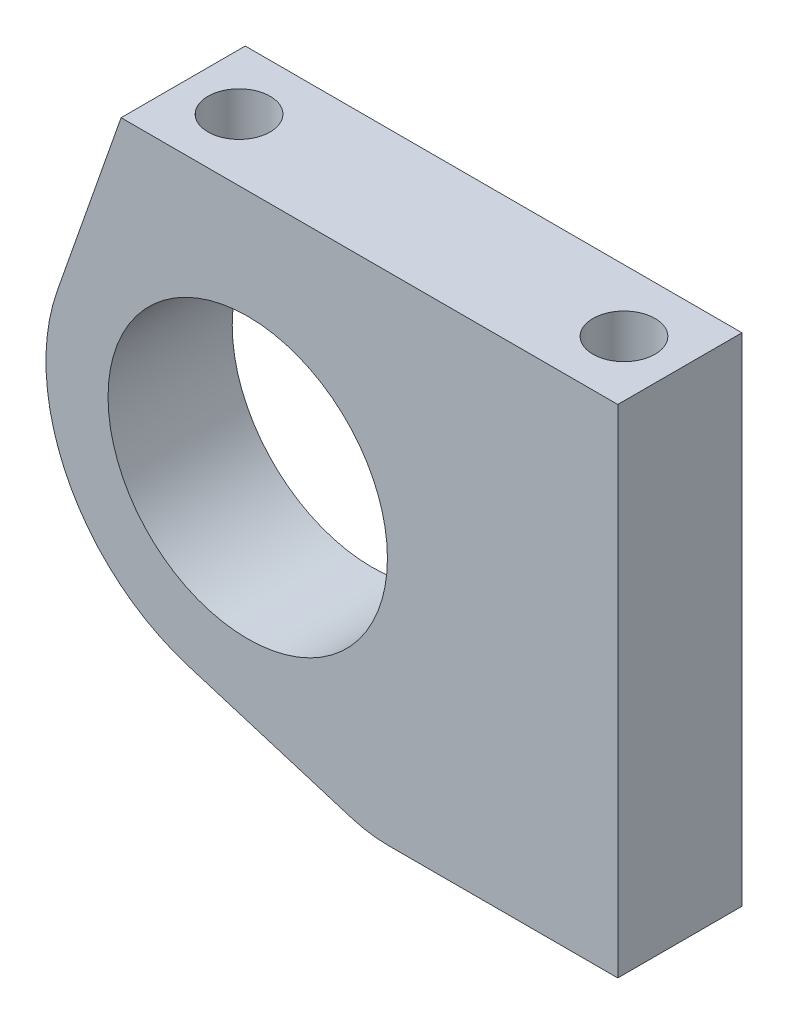
ISO-10303-21;
HEADER;
FILE_DESCRIPTION(('STEP AP214'),'2;1');
FILE_NAME('part.step','',(''),(''),'','','');
FILE_SCHEMA(('AUTOMOTIVE_DESIGN { 1 0 10303 214 1 1 1 1 }'));
ENDSEC;
DATA;
#1=APPLICATION_CONTEXT('core data for automotive mechanical design processes');
#2=APPLICATION_PROTOCOL_DEFINITION('international standard','automotive_design',2000,#1);
#3=PRODUCT_CONTEXT('',#1,'mechanical');
#4=PRODUCT('Part','Part','',(#3));
#5=PRODUCT_RELATED_PRODUCT_CATEGORY('part','',(#4));
#6=PRODUCT_DEFINITION_FORMATION('','',#4);
#7=PRODUCT_DEFINITION_CONTEXT('part definition',#1,'design');
#8=PRODUCT_DEFINITION('design','',#6,#7);
#9=PRODUCT_DEFINITION_SHAPE('','',#8);
#10=(LENGTH_UNIT() NAMED_UNIT(*) SI_UNIT(.MILLI.,.METRE.));
#11=(NAMED_UNIT(*) PLANE_ANGLE_UNIT() SI_UNIT($,.RADIAN.));
#12=(NAMED_UNIT(*) SI_UNIT($,.STERADIAN.) SOLID_ANGLE_UNIT());
#13=UNCERTAINTY_MEASURE_WITH_UNIT(LENGTH_MEASURE(1.E-05),#10,'distance_accuracy_value','');
#14=(GEOMETRIC_REPRESENTATION_CONTEXT(3) GLOBAL_UNCERTAINTY_ASSIGNED_CONTEXT((#13)) GLOBAL_UNIT_ASSIGNED_CONTEXT((#10,
#11,#12)) REPRESENTATION_CONTEXT('',''));
#15=CARTESIAN_POINT('',(0.,0.,0.));
#16=DIRECTION('',(0.,0.,1.));
#17=DIRECTION('',(1.,0.,0.));
#18=AXIS2_PLACEMENT_3D('',#15,#16,#17);
#19=CARTESIAN_POINT('',(2.18135779971547,7.11675250815941,12.7));
#20=DIRECTION('',(-0.293053285829138,-0.956096110056277,0.));
#21=DIRECTION('',(0.956096110056278,-0.293053285829138,0.));
#22=AXIS2_PLACEMENT_3D('',#19,#20,#21);
#23=PLANE('',#22);
#24=DIRECTION('',(-0.956096110056277,0.293053285829138,0.));
#25=VECTOR('',#24,1.);
#26=CARTESIAN_POINT('',(2.18135779971547,7.11675250815941,0.));
#27=LINE('',#26,#25);
#28=CARTESIAN_POINT('',(23.5808786205411,0.557579402285274,0.));
#29=VERTEX_POINT('',#28);
#30=CARTESIAN_POINT('',(6.90611281370116,5.66856652871357,0.));
#31=VERTEX_POINT('',#30);
#32=EDGE_CURVE('E145',#29,#31,#27,.T.);
#33=ORIENTED_EDGE('',*,*,#32,.F.);
#34=DIRECTION('',(0.,0.,-1.));
#35=VECTOR('',#34,1.);
#36=CARTESIAN_POINT('',(23.5808786205411,0.557579402285274,12.7));
#37=LINE('',#36,#35);
#38=CARTESIAN_POINT('',(23.5808786205411,0.557579402285274,12.7));
#39=VERTEX_POINT('',#38);
#40=EDGE_CURVE('E98',#39,#29,#37,.T.);
#41=ORIENTED_EDGE('',*,*,#40,.F.);
#42=DIRECTION('',(-0.956096110056277,0.293053285829138,0.));
#43=VECTOR('',#42,1.);
#44=CARTESIAN_POINT('',(2.18135779971547,7.11675250815941,12.7));
#45=LINE('',#44,#43);
#46=CARTESIAN_POINT('',(6.90611281370116,5.66856652871357,12.7));
#47=VERTEX_POINT('',#46);
#48=EDGE_CURVE('E166',#39,#47,#45,.T.);
#49=ORIENTED_EDGE('',*,*,#48,.T.);
#50=DIRECTION('',(0.,0.,-1.));
#51=VECTOR('',#50,1.);
#52=CARTESIAN_POINT('',(6.90611281370116,5.66856652871357,12.7));
#53=LINE('',#52,#51);
#54=EDGE_CURVE('E93',#47,#31,#53,.T.);
#55=ORIENTED_EDGE('',*,*,#54,.T.);
#56=EDGE_LOOP('',(#33,#41,#49,#55));
#57=FACE_BOUND('',#56,.T.);
#58=ADVANCED_FACE('F36',(#57),#23,.T.);
#59=CARTESIAN_POINT('',(27.3026553505712,12.7,12.7));
#60=DIRECTION('',(0.,0.,-1.));
#61=DIRECTION('',(-1.,0.,0.));
#62=AXIS2_PLACEMENT_3D('',#59,#60,#61);
#63=CYLINDRICAL_SURFACE('',#62,12.7);
#64=CARTESIAN_POINT('',(27.3026553505712,12.7,0.));
#65=DIRECTION('',(0.,0.,1.));
#66=DIRECTION('',(1.,0.,0.));
#67=AXIS2_PLACEMENT_3D('',#64,#65,#66);
#68=CIRCLE('',#67,12.7);
#69=CARTESIAN_POINT('',(27.3026553505712,0.,0.));
#70=VERTEX_POINT('',#69);
#71=EDGE_CURVE('E148',#29,#70,#68,.T.);
#72=ORIENTED_EDGE('',*,*,#71,.T.);
#73=DIRECTION('',(0.,0.,-1.));
#74=VECTOR('',#73,1.);
#75=CARTESIAN_POINT('',(27.3026553505712,0.,12.7));
#76=LINE('',#75,#74);
#77=CARTESIAN_POINT('',(27.3026553505712,0.,12.7));
#78=VERTEX_POINT('',#77);
#79=EDGE_CURVE('E172',#78,#70,#76,.T.);
#80=ORIENTED_EDGE('',*,*,#79,.F.);
#81=CARTESIAN_POINT('',(27.3026553505712,12.7,12.7));
#82=DIRECTION('',(0.,0.,1.));
#83=DIRECTION('',(1.,0.,0.));
#84=AXIS2_PLACEMENT_3D('',#81,#82,#83);
#85=CIRCLE('',#84,12.7);
#86=EDGE_CURVE('E193',#39,#78,#85,.T.);
#87=ORIENTED_EDGE('',*,*,#86,.F.);
#88=ORIENTED_EDGE('',*,*,#40,.T.);
#89=EDGE_LOOP('',(#72,#80,#87,#88));
#90=FACE_BOUND('',#89,.T.);
#91=ADVANCED_FACE('F209',(#90),#63,.T.);
#92=CARTESIAN_POINT('',(0.,0.,12.7));
#93=DIRECTION('',(0.,-1.,0.));
#94=DIRECTION('',(1.,0.,0.));
#95=AXIS2_PLACEMENT_3D('',#92,#93,#94);
#96=PLANE('',#95);
#97=DIRECTION('',(-1.,0.,0.));
#98=VECTOR('',#97,1.);
#99=CARTESIAN_POINT('',(0.,0.,0.));
#100=LINE('',#99,#98);
#101=CARTESIAN_POINT('',(50.8,0.,0.));
#102=VERTEX_POINT('',#101);
#103=EDGE_CURVE('E152',#102,#70,#100,.T.);
#104=ORIENTED_EDGE('',*,*,#103,.F.);
#105=DIRECTION('',(0.,0.,-1.));
#106=VECTOR('',#105,1.);
#107=CARTESIAN_POINT('',(50.8,0.,12.7));
#108=LINE('',#107,#106);
#109=CARTESIAN_POINT('',(50.8,0.,12.7));
#110=VERTEX_POINT('',#109);
#111=EDGE_CURVE('E170',#110,#102,#108,.T.);
#112=ORIENTED_EDGE('',*,*,#111,.F.);
#113=DIRECTION('',(-1.,0.,0.));
#114=VECTOR('',#113,1.);
#115=CARTESIAN_POINT('',(0.,0.,12.7));
#116=LINE('',#115,#114);
#117=EDGE_CURVE('E137',#110,#78,#116,.T.);
#118=ORIENTED_EDGE('',*,*,#117,.T.);
#119=ORIENTED_EDGE('',*,*,#79,.T.);
#120=EDGE_LOOP('',(#104,#112,#118,#119));
#121=FACE_BOUND('',#120,.T.);
#122=ADVANCED_FACE('F197',(#121),#96,.T.);
#123=CARTESIAN_POINT('',(50.8,0.,12.7));
#124=DIRECTION('',(1.,0.,0.));
#125=DIRECTION('',(0.,1.,0.));
#126=AXIS2_PLACEMENT_3D('',#123,#124,#125);
#127=PLANE('',#126);
#128=DIRECTION('',(0.,-1.,0.));
#129=VECTOR('',#128,1.);
#130=CARTESIAN_POINT('',(50.8,0.,0.));
#131=LINE('',#130,#129);
#132=CARTESIAN_POINT('',(50.8,50.8,0.));
#133=VERTEX_POINT('',#132);
#134=EDGE_CURVE('E155',#133,#102,#131,.T.);
#135=ORIENTED_EDGE('',*,*,#134,.F.);
#136=DIRECTION('',(0.,0.,-1.));
#137=VECTOR('',#136,1.);
#138=CARTESIAN_POINT('',(50.8,50.8,12.7));
#139=LINE('',#138,#137);
#140=CARTESIAN_POINT('',(50.8,50.8,12.7));
#141=VERTEX_POINT('',#140);
#142=EDGE_CURVE('E122',#141,#133,#139,.T.);
#143=ORIENTED_EDGE('',*,*,#142,.F.);
#144=DIRECTION('',(0.,-1.,0.));
#145=VECTOR('',#144,1.);
#146=CARTESIAN_POINT('',(50.8,0.,12.7));
#147=LINE('',#146,#145);
#148=EDGE_CURVE('E135',#141,#110,#147,.T.);
#149=ORIENTED_EDGE('',*,*,#148,.T.);
#150=ORIENTED_EDGE('',*,*,#111,.T.);
#151=EDGE_LOOP('',(#135,#143,#149,#150));
#152=FACE_BOUND('',#151,.T.);
#153=ADVANCED_FACE('F201',(#152),#127,.T.);
#154=CARTESIAN_POINT('',(0.,50.8,12.7));
#155=DIRECTION('',(0.,1.,0.));
#156=DIRECTION('',(0.,0.,1.));
#157=AXIS2_PLACEMENT_3D('',#154,#155,#156);
#158=PLANE('',#157);
#159=CARTESIAN_POINT('',(45.085,50.8,6.35));
#160=DIRECTION('',(0.,1.,0.));
#161=DIRECTION('',(0.,0.,1.));
#162=AXIS2_PLACEMENT_3D('',#159,#160,#161);
#163=CIRCLE('',#162,3.175);
#164=CARTESIAN_POINT('',(45.085,50.8,9.525));
#165=VERTEX_POINT('',#164);
#166=EDGE_CURVE('E183',#165,#165,#163,.T.);
#167=ORIENTED_EDGE('',*,*,#166,.F.);
#168=EDGE_LOOP('',(#167));
#169=FACE_BOUND('',#168,.T.);
#170=CARTESIAN_POINT('',(5.715,50.8,6.35));
#171=DIRECTION('',(0.,1.,0.));
#172=DIRECTION('',(0.,0.,1.));
#173=AXIS2_PLACEMENT_3D('',#170,#171,#172);
#174=CIRCLE('',#173,3.175);
#175=CARTESIAN_POINT('',(5.715,50.8,9.525));
#176=VERTEX_POINT('',#175);
#177=EDGE_CURVE('E184',#176,#176,#174,.T.);
#178=ORIENTED_EDGE('',*,*,#177,.F.);
#179=EDGE_LOOP('',(#178));
#180=FACE_BOUND('',#179,.T.);
#181=DIRECTION('',(1.,0.,0.));
#182=VECTOR('',#181,1.);
#183=CARTESIAN_POINT('',(0.,50.8,0.));
#184=LINE('',#183,#182);
#185=CARTESIAN_POINT('',(0.,50.8,0.));
#186=VERTEX_POINT('',#185);
#187=EDGE_CURVE('E119',#186,#133,#184,.T.);
#188=ORIENTED_EDGE('',*,*,#187,.F.);
#189=DIRECTION('',(0.,0.,-1.));
#190=VECTOR('',#189,1.);
#191=CARTESIAN_POINT('',(0.,50.8,12.7));
#192=LINE('',#191,#190);
#193=CARTESIAN_POINT('',(0.,50.8,12.7));
#194=VERTEX_POINT('',#193);
#195=EDGE_CURVE('E113',#194,#186,#192,.T.);
#196=ORIENTED_EDGE('',*,*,#195,.F.);
#197=DIRECTION('',(1.,0.,0.));
#198=VECTOR('',#197,1.);
#199=CARTESIAN_POINT('',(0.,50.8,12.7));
#200=LINE('',#199,#198);
#201=EDGE_CURVE('E117',#194,#141,#200,.T.);
#202=ORIENTED_EDGE('',*,*,#201,.T.);
#203=ORIENTED_EDGE('',*,*,#142,.T.);
#204=EDGE_LOOP('',(#188,#196,#202,#203));
#205=FACE_BOUND('',#204,.T.);
#206=ADVANCED_FACE('F115',(#169,#180,#205),#158,.T.);
#207=CARTESIAN_POINT('',(-15.8796743170508,5.57587470821483,12.7));
#208=DIRECTION('',(0.943524608500576,-0.331302449664706,0.));
#209=DIRECTION('',(0.331302449664706,0.943524608500576,0.));
#210=AXIS2_PLACEMENT_3D('',#207,#208,#209);
#211=PLANE('',#210);
#212=DIRECTION('',(-0.331302449664706,-0.943524608500576,0.));
#213=VECTOR('',#212,1.);
#214=CARTESIAN_POINT('',(-15.8796743170508,5.57587470821483,0.));
#215=LINE('',#214,#213);
#216=CARTESIAN_POINT('',(-6.51798910793064,32.2372543049554,0.));
#217=VERTEX_POINT('',#216);
#218=EDGE_CURVE('E159',#186,#217,#215,.T.);
#219=ORIENTED_EDGE('',*,*,#218,.T.);
#220=DIRECTION('',(0.,0.,-1.));
#221=VECTOR('',#220,1.);
#222=CARTESIAN_POINT('',(-6.51798910793064,32.2372543049554,12.7));
#223=LINE('',#222,#221);
#224=CARTESIAN_POINT('',(-6.51798910793064,32.2372543049554,12.7));
#225=VERTEX_POINT('',#224);
#226=EDGE_CURVE('E123',#225,#217,#223,.T.);
#227=ORIENTED_EDGE('',*,*,#226,.F.);
#228=DIRECTION('',(-0.331302449664706,-0.943524608500576,0.));
#229=VECTOR('',#228,1.);
#230=CARTESIAN_POINT('',(-15.8796743170508,5.57587470821483,12.7));
#231=LINE('',#230,#229);
#232=EDGE_CURVE('E126',#194,#225,#231,.T.);
#233=ORIENTED_EDGE('',*,*,#232,.F.);
#234=ORIENTED_EDGE('',*,*,#195,.T.);
#235=EDGE_LOOP('',(#219,#227,#233,#234));
#236=FACE_BOUND('',#235,.T.);
#237=ADVANCED_FACE('F127',(#236),#211,.F.);
#238=CARTESIAN_POINT('',(12.954,25.4,12.7));
#239=DIRECTION('',(0.,0.,-1.));
#240=DIRECTION('',(-1.,0.,0.));
#241=AXIS2_PLACEMENT_3D('',#238,#239,#240);
#242=CYLINDRICAL_SURFACE('',#241,20.6375);
#243=CARTESIAN_POINT('',(12.954,25.4,0.));
#244=DIRECTION('',(0.,0.,1.));
#245=DIRECTION('',(1.,0.,0.));
#246=AXIS2_PLACEMENT_3D('',#243,#244,#245);
#247=CIRCLE('',#246,20.6375);
#248=EDGE_CURVE('E161',#217,#31,#247,.T.);
#249=ORIENTED_EDGE('',*,*,#248,.T.);
#250=ORIENTED_EDGE('',*,*,#54,.F.);
#251=CARTESIAN_POINT('',(12.954,25.4,12.7));
#252=DIRECTION('',(0.,0.,1.));
#253=DIRECTION('',(1.,0.,0.));
#254=AXIS2_PLACEMENT_3D('',#251,#252,#253);
#255=CIRCLE('',#254,20.6375);
#256=EDGE_CURVE('E63',#225,#47,#255,.T.);
#257=ORIENTED_EDGE('',*,*,#256,.F.);
#258=ORIENTED_EDGE('',*,*,#226,.T.);
#259=EDGE_LOOP('',(#249,#250,#257,#258));
#260=FACE_BOUND('',#259,.T.);
#261=ADVANCED_FACE('F207',(#260),#242,.T.);
#262=CARTESIAN_POINT('',(12.954,25.4,12.7));
#263=DIRECTION('',(0.,0.,-1.));
#264=DIRECTION('',(-1.,0.,0.));
#265=AXIS2_PLACEMENT_3D('',#262,#263,#264);
#266=CYLINDRICAL_SURFACE('',#265,14.2875);
#267=CARTESIAN_POINT('',(6.40856981933194,38.1,3.2516801479331));
#268=CARTESIAN_POINT('',(6.49262928168267,38.1433330302217,3.27048787780294));
#269=CARTESIAN_POINT('',(6.57651295891144,38.1854998225958,3.29286713989402));
#270=CARTESIAN_POINT('',(6.74329910889614,38.2673391922889,3.34486345502422));
#271=CARTESIAN_POINT('',(6.82620107963218,38.3070105347212,3.37448405659799));
#272=CARTESIAN_POINT('',(6.99052144956765,38.3837529585996,3.44112509703087));
#273=CARTESIAN_POINT('',(7.07193548249216,38.4208170866329,3.47816438035866));
#274=CARTESIAN_POINT('',(7.23230413698856,38.4920795361814,3.55957047123413));
#275=CARTESIAN_POINT('',(7.31125916612597,38.5262783342137,3.60393605672486));
#276=CARTESIAN_POINT('',(7.46620406011125,38.5918100502895,3.70004781752788));
#277=CARTESIAN_POINT('',(7.54218347031692,38.6231333072968,3.75181747830552));
#278=CARTESIAN_POINT('',(7.69013661002703,38.6827242199716,3.86243164213683));
#279=CARTESIAN_POINT('',(7.76210879004813,38.7109906975948,3.92127885446642));
#280=CARTESIAN_POINT('',(7.90109447281517,38.7643680597351,4.0455942518419));
#281=CARTESIAN_POINT('',(7.96811737955947,38.7894849955473,4.11104929013986));
#282=CARTESIAN_POINT('',(8.09660860100073,38.8366325316567,4.24823474387611));
#283=CARTESIAN_POINT('',(8.15807499863943,38.8586620681979,4.31996730846003));
#284=CARTESIAN_POINT('',(8.32506740402169,38.9173555501922,4.53362602741067));
#285=CARTESIAN_POINT('',(8.42290903947735,38.950268639514,4.68276593021822));
#286=CARTESIAN_POINT('',(8.5927466647164,39.0058878997683,4.99681185089612));
#287=CARTESIAN_POINT('',(8.66473568588146,39.0285913190812,5.16172210454671));
#288=CARTESIAN_POINT('',(8.77767650571949,39.0636136738503,5.49537481186849));
#289=CARTESIAN_POINT('',(8.81976713624475,39.0763159091858,5.66369163263446));
#290=CARTESIAN_POINT('',(8.8759771414601,39.0931831910233,6.00531435772264));
#291=CARTESIAN_POINT('',(8.89010319788656,39.0973502768858,6.17861906021894));
#292=CARTESIAN_POINT('',(8.88989680766538,39.097288636852,6.52327292355303));
#293=CARTESIAN_POINT('',(8.87587926601057,39.0931528140979,6.69462238708347));
#294=CARTESIAN_POINT('',(8.82051186451713,39.0765403668223,7.03243272303412));
#295=CARTESIAN_POINT('',(8.77916172611865,39.0640636572945,7.19889354561374));
#296=CARTESIAN_POINT('',(8.67062211047569,39.0304267088797,7.52217116490554));
#297=CARTESIAN_POINT('',(8.60344080900472,39.0092692173887,7.67899099487293));
#298=CARTESIAN_POINT('',(8.44567739227698,38.9578218737996,7.97871261437543));
#299=CARTESIAN_POINT('',(8.35509715804297,38.9275327557534,8.12161552141062));
#300=CARTESIAN_POINT('',(8.15290114228945,38.8571034900467,8.39105226649182));
#301=CARTESIAN_POINT('',(8.04109919631959,38.8168751306535,8.51742311543334));
#302=CARTESIAN_POINT('',(7.80106725807857,38.7265281687073,8.749335821217));
#303=CARTESIAN_POINT('',(7.67283177311779,38.676406256327,8.85487068381027));
#304=CARTESIAN_POINT('',(7.40000149005537,38.5646566724587,9.04631152784263));
#305=CARTESIAN_POINT('',(7.25500561967952,38.5027029962861,9.13145191427891));
#306=CARTESIAN_POINT('',(6.95725369443311,38.3691261488149,9.27657166450147));
#307=CARTESIAN_POINT('',(6.80450470572726,38.2975116870169,9.33657349371711));
#308=CARTESIAN_POINT('',(6.61011569449593,38.2019457383489,9.3965007705813));
#309=CARTESIAN_POINT('',(6.56987185841964,38.181925256473,9.40803286539982));
#310=CARTESIAN_POINT('',(6.48929431279828,38.1413600783939,9.42941918013631));
#311=CARTESIAN_POINT('',(6.44896087680961,38.1208163428515,9.43927625128453));
#312=CARTESIAN_POINT('',(6.40856981933194,38.1,9.44831985206691));
#313=B_SPLINE_CURVE_WITH_KNOTS('',3,(#267,#268,#269,#270,#271,#272,#273,#274,#275,#276,#277,
#278,#279,#280,#281,#282,#283,#284,#285,#286,#287,#288,#289,#290,#291,#292,#293,#294,#295,#296,
#297,#298,#299,#300,#301,#302,#303,#304,#305,#306,#307,#308,#309,#310,#311,#312),.UNSPECIFIED.,
.F.,.F.,(4,2,2,2,2,2,2,2,2,2,2,2,2,2,2,2,2,2,2,2,2,2,4),(0.,0.289226456911081,0.578594931007181,
0.868707981548664,1.15877268884614,1.44977876335392,1.74089659123582,2.03144622581324,
2.32209572373149,2.86324526300145,3.40454056080165,3.9239154534375,4.4431662338605,
4.95663938136473,5.47011776200562,5.98343375616112,6.49670849806126,7.01471342752194,
7.53289194695295,8.06822712009181,8.60308285757037,8.74227810630689,8.88123399002891),.UNSPECIFIED.);
#314=CARTESIAN_POINT('',(6.40856981933194,38.1,3.2516801479331));
#315=VERTEX_POINT('',#314);
#316=CARTESIAN_POINT('',(6.40856981933194,38.1,9.4483198520669));
#317=VERTEX_POINT('',#316);
#318=EDGE_CURVE('E11',#315,#317,#313,.T.);
#319=ORIENTED_EDGE('',*,*,#318,.F.);
#320=DIRECTION('',(0.,0.,-1.));
#321=VECTOR('',#320,1.);
#322=CARTESIAN_POINT('',(6.40856981933194,38.1,12.7));
#323=LINE('',#322,#321);
#324=EDGE_CURVE('E49',#315,#317,#323,.F.);
#325=ORIENTED_EDGE('',*,*,#324,.T.);
#326=EDGE_LOOP('',(#319,#325));
#327=FACE_BOUND('',#326,.T.);
#328=CARTESIAN_POINT('',(12.954,25.4,12.7));
#329=DIRECTION('',(0.,0.,1.));
#330=DIRECTION('',(1.,0.,0.));
#331=AXIS2_PLACEMENT_3D('',#328,#329,#330);
#332=CIRCLE('',#331,14.2875);
#333=CARTESIAN_POINT('',(27.2415,25.4,12.7));
#334=VERTEX_POINT('',#333);
#335=EDGE_CURVE('E142',#334,#334,#332,.T.);
#336=ORIENTED_EDGE('',*,*,#335,.T.);
#337=EDGE_LOOP('',(#336));
#338=FACE_BOUND('',#337,.T.);
#339=CARTESIAN_POINT('',(12.954,25.4,0.));
#340=DIRECTION('',(0.,0.,1.));
#341=DIRECTION('',(1.,0.,0.));
#342=AXIS2_PLACEMENT_3D('',#339,#340,#341);
#343=CIRCLE('',#342,14.2875);
#344=CARTESIAN_POINT('',(27.2415,25.4,0.));
#345=VERTEX_POINT('',#344);
#346=EDGE_CURVE('E163',#345,#345,#343,.T.);
#347=ORIENTED_EDGE('',*,*,#346,.F.);
#348=EDGE_LOOP('',(#347));
#349=FACE_BOUND('',#348,.T.);
#350=ADVANCED_FACE('F177',(#327,#338,#349),#266,.F.);
#351=CARTESIAN_POINT('',(0.,0.,12.7));
#352=DIRECTION('',(0.,0.,1.));
#353=DIRECTION('',(1.,0.,0.));
#354=AXIS2_PLACEMENT_3D('',#351,#352,#353);
#355=PLANE('',#354);
#356=ORIENTED_EDGE('',*,*,#48,.F.);
#357=ORIENTED_EDGE('',*,*,#86,.T.);
#358=ORIENTED_EDGE('',*,*,#117,.F.);
#359=ORIENTED_EDGE('',*,*,#148,.F.);
#360=ORIENTED_EDGE('',*,*,#201,.F.);
#361=ORIENTED_EDGE('',*,*,#232,.T.);
#362=ORIENTED_EDGE('',*,*,#256,.T.);
#363=EDGE_LOOP('',(#356,#357,#358,#359,#360,#361,#362));
#364=FACE_BOUND('',#363,.T.);
#365=ORIENTED_EDGE('',*,*,#335,.F.);
#366=EDGE_LOOP('',(#365));
#367=FACE_BOUND('',#366,.T.);
#368=ADVANCED_FACE('F131',(#364,#367),#355,.T.);
#369=CARTESIAN_POINT('',(0.,0.,0.));
#370=DIRECTION('',(0.,0.,1.));
#371=DIRECTION('',(1.,0.,0.));
#372=AXIS2_PLACEMENT_3D('',#369,#370,#371);
#373=PLANE('',#372);
#374=ORIENTED_EDGE('',*,*,#32,.T.);
#375=ORIENTED_EDGE('',*,*,#248,.F.);
#376=ORIENTED_EDGE('',*,*,#218,.F.);
#377=ORIENTED_EDGE('',*,*,#187,.T.);
#378=ORIENTED_EDGE('',*,*,#134,.T.);
#379=ORIENTED_EDGE('',*,*,#103,.T.);
#380=ORIENTED_EDGE('',*,*,#71,.F.);
#381=EDGE_LOOP('',(#374,#375,#376,#377,#378,#379,#380));
#382=FACE_BOUND('',#381,.T.);
#383=ORIENTED_EDGE('',*,*,#346,.T.);
#384=EDGE_LOOP('',(#383));
#385=FACE_BOUND('',#384,.T.);
#386=ADVANCED_FACE('F203',(#382,#385),#373,.F.);
#387=CARTESIAN_POINT('',(5.715,38.1,6.35));
#388=DIRECTION('',(0.,1.,0.));
#389=DIRECTION('',(0.,0.,1.));
#390=AXIS2_PLACEMENT_3D('',#387,#388,#389);
#391=CYLINDRICAL_SURFACE('',#390,3.175);
#392=ORIENTED_EDGE('',*,*,#318,.T.);
#393=CARTESIAN_POINT('',(5.715,38.1,6.35));
#394=DIRECTION('',(0.,1.,0.));
#395=DIRECTION('',(0.,0.,1.));
#396=AXIS2_PLACEMENT_3D('',#393,#394,#395);
#397=CIRCLE('',#396,3.175);
#398=EDGE_CURVE('E55',#315,#317,#397,.T.);
#399=ORIENTED_EDGE('',*,*,#398,.F.);
#400=EDGE_LOOP('',(#392,#399));
#401=FACE_BOUND('',#400,.T.);
#402=ORIENTED_EDGE('',*,*,#177,.T.);
#403=EDGE_LOOP('',(#402));
#404=FACE_BOUND('',#403,.T.);
#405=ADVANCED_FACE('F181',(#401,#404),#391,.F.);
#406=CARTESIAN_POINT('',(5.715,38.1,6.35));
#407=DIRECTION('',(0.,1.,0.));
#408=DIRECTION('',(0.,0.,1.));
#409=AXIS2_PLACEMENT_3D('',#406,#407,#408);
#410=PLANE('',#409);
#411=ORIENTED_EDGE('',*,*,#398,.T.);
#412=ORIENTED_EDGE('',*,*,#324,.F.);
#413=EDGE_LOOP('',(#411,#412));
#414=FACE_BOUND('',#413,.T.);
#415=ADVANCED_FACE('F179',(#414),#410,.T.);
#416=CARTESIAN_POINT('',(45.085,38.1,6.35));
#417=DIRECTION('',(0.,1.,0.));
#418=DIRECTION('',(0.,0.,1.));
#419=AXIS2_PLACEMENT_3D('',#416,#417,#418);
#420=CYLINDRICAL_SURFACE('',#419,3.175);
#421=CARTESIAN_POINT('',(45.085,38.1,6.35));
#422=DIRECTION('',(0.,1.,0.));
#423=DIRECTION('',(0.,0.,1.));
#424=AXIS2_PLACEMENT_3D('',#421,#422,#423);
#425=CIRCLE('',#424,3.175);
#426=CARTESIAN_POINT('',(45.085,38.1,9.525));
#427=VERTEX_POINT('',#426);
#428=EDGE_CURVE('E149',#427,#427,#425,.T.);
#429=ORIENTED_EDGE('',*,*,#428,.F.);
#430=EDGE_LOOP('',(#429));
#431=FACE_BOUND('',#430,.T.);
#432=ORIENTED_EDGE('',*,*,#166,.T.);
#433=EDGE_LOOP('',(#432));
#434=FACE_BOUND('',#433,.T.);
#435=ADVANCED_FACE('F238',(#431,#434),#420,.F.);
#436=CARTESIAN_POINT('',(45.085,38.1,6.35));
#437=DIRECTION('',(0.,1.,0.));
#438=DIRECTION('',(0.,0.,1.));
#439=AXIS2_PLACEMENT_3D('',#436,#437,#438);
#440=PLANE('',#439);
#441=ORIENTED_EDGE('',*,*,#428,.T.);
#442=EDGE_LOOP('',(#441));
#443=FACE_BOUND('',#442,.T.);
#444=ADVANCED_FACE('F241',(#443),#440,.T.);
#445=CLOSED_SHELL('',(#58,#91,#122,#153,#206,#237,#261,#350,#368,#386,#405,#415,#435,#444));
#446=MANIFOLD_SOLID_BREP('B2',#445);
#447=ADVANCED_BREP_SHAPE_REPRESENTATION('',(#18,#446),#14);
#448=SHAPE_DEFINITION_REPRESENTATION(#9,#447);
ENDSEC;
END-ISO-10303-21;
